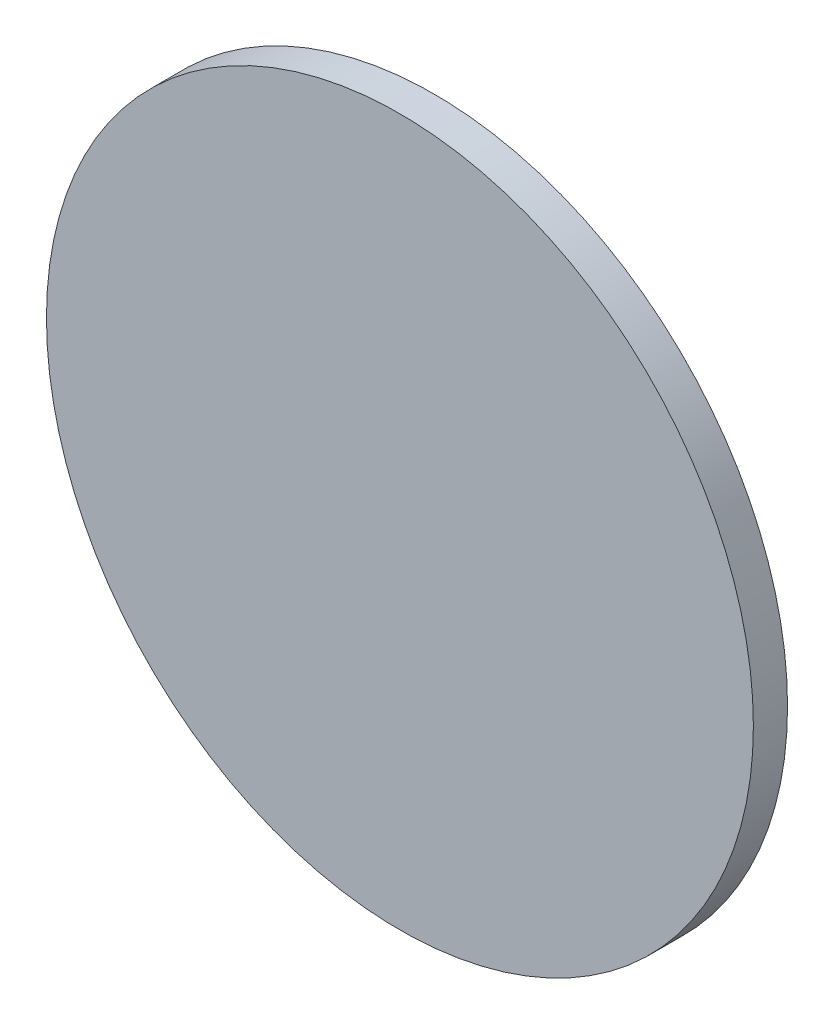
ISO-10303-21;
HEADER;
FILE_DESCRIPTION(('STEP AP214'),'2;1');
FILE_NAME('part.step','',(''),(''),'','','');
FILE_SCHEMA(('AUTOMOTIVE_DESIGN { 1 0 10303 214 1 1 1 1 }'));
ENDSEC;
DATA;
#1=APPLICATION_CONTEXT('core data for automotive mechanical design processes');
#2=APPLICATION_PROTOCOL_DEFINITION('international standard','automotive_design',2000,#1);
#3=PRODUCT_CONTEXT('',#1,'mechanical');
#4=PRODUCT('Part','Part','',(#3));
#5=PRODUCT_RELATED_PRODUCT_CATEGORY('part','',(#4));
#6=PRODUCT_DEFINITION_FORMATION('','',#4);
#7=PRODUCT_DEFINITION_CONTEXT('part definition',#1,'design');
#8=PRODUCT_DEFINITION('design','',#6,#7);
#9=PRODUCT_DEFINITION_SHAPE('','',#8);
#10=(LENGTH_UNIT() NAMED_UNIT(*) SI_UNIT(.MILLI.,.METRE.));
#11=(NAMED_UNIT(*) PLANE_ANGLE_UNIT() SI_UNIT($,.RADIAN.));
#12=(NAMED_UNIT(*) SI_UNIT($,.STERADIAN.) SOLID_ANGLE_UNIT());
#13=UNCERTAINTY_MEASURE_WITH_UNIT(LENGTH_MEASURE(1.E-05),#10,'distance_accuracy_value','');
#14=(GEOMETRIC_REPRESENTATION_CONTEXT(3) GLOBAL_UNCERTAINTY_ASSIGNED_CONTEXT((#13)) GLOBAL_UNIT_ASSIGNED_CONTEXT((#10,
#11,#12)) REPRESENTATION_CONTEXT('',''));
#15=CARTESIAN_POINT('',(0.,0.,0.));
#16=DIRECTION('',(0.,0.,1.));
#17=DIRECTION('',(1.,0.,0.));
#18=AXIS2_PLACEMENT_3D('',#15,#16,#17);
#19=CARTESIAN_POINT('',(0.,0.,1.5875));
#20=DIRECTION('',(0.,0.,-1.));
#21=DIRECTION('',(-1.,0.,0.));
#22=AXIS2_PLACEMENT_3D('',#19,#20,#21);
#23=CYLINDRICAL_SURFACE('',#22,16.4211);
#24=CARTESIAN_POINT('',(0.,0.,1.5875));
#25=DIRECTION('',(0.,0.,1.));
#26=DIRECTION('',(1.,0.,0.));
#27=AXIS2_PLACEMENT_3D('',#24,#25,#26);
#28=CIRCLE('',#27,16.4211);
#29=CARTESIAN_POINT('',(16.4211,0.,1.5875));
#30=VERTEX_POINT('',#29);
#31=EDGE_CURVE('E10',#30,#30,#28,.T.);
#32=ORIENTED_EDGE('',*,*,#31,.F.);
#33=EDGE_LOOP('',(#32));
#34=FACE_BOUND('',#33,.T.);
#35=CARTESIAN_POINT('',(0.,0.,0.));
#36=DIRECTION('',(0.,0.,1.));
#37=DIRECTION('',(1.,0.,0.));
#38=AXIS2_PLACEMENT_3D('',#35,#36,#37);
#39=CIRCLE('',#38,16.4211);
#40=CARTESIAN_POINT('',(16.4211,0.,0.));
#41=VERTEX_POINT('',#40);
#42=EDGE_CURVE('E33',#41,#41,#39,.T.);
#43=ORIENTED_EDGE('',*,*,#42,.T.);
#44=EDGE_LOOP('',(#43));
#45=FACE_BOUND('',#44,.T.);
#46=ADVANCED_FACE('F30',(#34,#45),#23,.T.);
#47=CARTESIAN_POINT('',(0.,0.,1.5875));
#48=DIRECTION('',(0.,0.,1.));
#49=DIRECTION('',(1.,0.,0.));
#50=AXIS2_PLACEMENT_3D('',#47,#48,#49);
#51=PLANE('',#50);
#52=ORIENTED_EDGE('',*,*,#31,.T.);
#53=EDGE_LOOP('',(#52));
#54=FACE_BOUND('',#53,.T.);
#55=ADVANCED_FACE('F45',(#54),#51,.T.);
#56=CARTESIAN_POINT('',(0.,0.,0.));
#57=DIRECTION('',(0.,0.,1.));
#58=DIRECTION('',(1.,0.,0.));
#59=AXIS2_PLACEMENT_3D('',#56,#57,#58);
#60=PLANE('',#59);
#61=ORIENTED_EDGE('',*,*,#42,.F.);
#62=EDGE_LOOP('',(#61));
#63=FACE_BOUND('',#62,.T.);
#64=ADVANCED_FACE('F43',(#63),#60,.F.);
#65=CLOSED_SHELL('',(#46,#55,#64));
#66=MANIFOLD_SOLID_BREP('B2',#65);
#67=ADVANCED_BREP_SHAPE_REPRESENTATION('',(#18,#66),#14);
#68=SHAPE_DEFINITION_REPRESENTATION(#9,#67);
ENDSEC;
END-ISO-10303-21;
